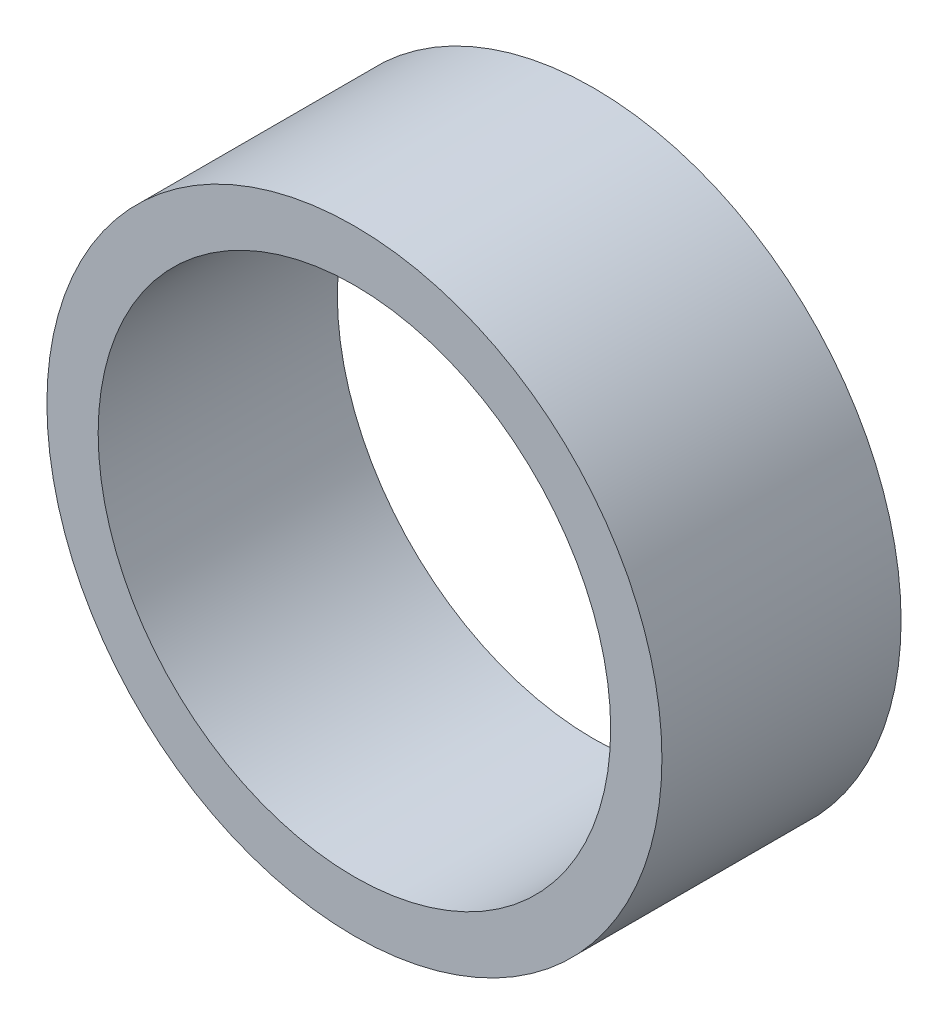
ISO-10303-21;
HEADER;
FILE_DESCRIPTION(('STEP AP214'),'2;1');
FILE_NAME('part.step','',(''),(''),'','','');
FILE_SCHEMA(('AUTOMOTIVE_DESIGN { 1 0 10303 214 1 1 1 1 }'));
ENDSEC;
DATA;
#1=APPLICATION_CONTEXT('core data for automotive mechanical design processes');
#2=APPLICATION_PROTOCOL_DEFINITION('international standard','automotive_design',2000,#1);
#3=PRODUCT_CONTEXT('',#1,'mechanical');
#4=PRODUCT('Part','Part','',(#3));
#5=PRODUCT_RELATED_PRODUCT_CATEGORY('part','',(#4));
#6=PRODUCT_DEFINITION_FORMATION('','',#4);
#7=PRODUCT_DEFINITION_CONTEXT('part definition',#1,'design');
#8=PRODUCT_DEFINITION('design','',#6,#7);
#9=PRODUCT_DEFINITION_SHAPE('','',#8);
#10=(LENGTH_UNIT() NAMED_UNIT(*) SI_UNIT(.MILLI.,.METRE.));
#11=(NAMED_UNIT(*) PLANE_ANGLE_UNIT() SI_UNIT($,.RADIAN.));
#12=(NAMED_UNIT(*) SI_UNIT($,.STERADIAN.) SOLID_ANGLE_UNIT());
#13=UNCERTAINTY_MEASURE_WITH_UNIT(LENGTH_MEASURE(1.E-05),#10,'distance_accuracy_value','');
#14=(GEOMETRIC_REPRESENTATION_CONTEXT(3) GLOBAL_UNCERTAINTY_ASSIGNED_CONTEXT((#13)) GLOBAL_UNIT_ASSIGNED_CONTEXT((#10,
#11,#12)) REPRESENTATION_CONTEXT('',''));
#15=CARTESIAN_POINT('',(0.,0.,0.));
#16=DIRECTION('',(0.,0.,1.));
#17=DIRECTION('',(1.,0.,0.));
#18=AXIS2_PLACEMENT_3D('',#15,#16,#17);
#19=CARTESIAN_POINT('',(0.,0.,7.));
#20=DIRECTION('',(0.,0.,1.));
#21=DIRECTION('',(1.,0.,0.));
#22=AXIS2_PLACEMENT_3D('',#19,#20,#21);
#23=PLANE('',#22);
#24=CARTESIAN_POINT('',(0.,0.,7.));
#25=DIRECTION('',(0.,0.,1.));
#26=DIRECTION('',(1.,0.,0.));
#27=AXIS2_PLACEMENT_3D('',#24,#25,#26);
#28=CIRCLE('',#27,9.);
#29=CARTESIAN_POINT('',(9.,0.,7.));
#30=VERTEX_POINT('',#29);
#31=EDGE_CURVE('E10',#30,#30,#28,.T.);
#32=ORIENTED_EDGE('',*,*,#31,.T.);
#33=EDGE_LOOP('',(#32));
#34=FACE_BOUND('',#33,.T.);
#35=CARTESIAN_POINT('',(0.,0.,7.));
#36=DIRECTION('',(0.,0.,1.));
#37=DIRECTION('',(1.,0.,0.));
#38=AXIS2_PLACEMENT_3D('',#35,#36,#37);
#39=CIRCLE('',#38,7.5);
#40=CARTESIAN_POINT('',(7.5,0.,7.));
#41=VERTEX_POINT('',#40);
#42=EDGE_CURVE('E41',#41,#41,#39,.T.);
#43=ORIENTED_EDGE('',*,*,#42,.F.);
#44=EDGE_LOOP('',(#43));
#45=FACE_BOUND('',#44,.T.);
#46=ADVANCED_FACE('F30',(#34,#45),#23,.T.);
#47=CARTESIAN_POINT('',(0.,0.,0.));
#48=DIRECTION('',(0.,0.,1.));
#49=DIRECTION('',(1.,0.,0.));
#50=AXIS2_PLACEMENT_3D('',#47,#48,#49);
#51=PLANE('',#50);
#52=CARTESIAN_POINT('',(0.,0.,0.));
#53=DIRECTION('',(0.,0.,1.));
#54=DIRECTION('',(1.,0.,0.));
#55=AXIS2_PLACEMENT_3D('',#52,#53,#54);
#56=CIRCLE('',#55,9.);
#57=CARTESIAN_POINT('',(9.,0.,0.));
#58=VERTEX_POINT('',#57);
#59=EDGE_CURVE('E34',#58,#58,#56,.T.);
#60=ORIENTED_EDGE('',*,*,#59,.F.);
#61=EDGE_LOOP('',(#60));
#62=FACE_BOUND('',#61,.T.);
#63=CARTESIAN_POINT('',(0.,0.,0.));
#64=DIRECTION('',(0.,0.,1.));
#65=DIRECTION('',(1.,0.,0.));
#66=AXIS2_PLACEMENT_3D('',#63,#64,#65);
#67=CIRCLE('',#66,7.5);
#68=CARTESIAN_POINT('',(7.5,0.,0.));
#69=VERTEX_POINT('',#68);
#70=EDGE_CURVE('E43',#69,#69,#67,.T.);
#71=ORIENTED_EDGE('',*,*,#70,.T.);
#72=EDGE_LOOP('',(#71));
#73=FACE_BOUND('',#72,.T.);
#74=ADVANCED_FACE('F53',(#62,#73),#51,.F.);
#75=CARTESIAN_POINT('',(0.,0.,7.));
#76=DIRECTION('',(0.,0.,-1.));
#77=DIRECTION('',(-1.,0.,0.));
#78=AXIS2_PLACEMENT_3D('',#75,#76,#77);
#79=CYLINDRICAL_SURFACE('',#78,9.);
#80=ORIENTED_EDGE('',*,*,#31,.F.);
#81=EDGE_LOOP('',(#80));
#82=FACE_BOUND('',#81,.T.);
#83=ORIENTED_EDGE('',*,*,#59,.T.);
#84=EDGE_LOOP('',(#83));
#85=FACE_BOUND('',#84,.T.);
#86=ADVANCED_FACE('F32',(#82,#85),#79,.T.);
#87=CARTESIAN_POINT('',(0.,0.,7.));
#88=DIRECTION('',(0.,0.,-1.));
#89=DIRECTION('',(-1.,0.,0.));
#90=AXIS2_PLACEMENT_3D('',#87,#88,#89);
#91=CYLINDRICAL_SURFACE('',#90,7.5);
#92=ORIENTED_EDGE('',*,*,#42,.T.);
#93=EDGE_LOOP('',(#92));
#94=FACE_BOUND('',#93,.T.);
#95=ORIENTED_EDGE('',*,*,#70,.F.);
#96=EDGE_LOOP('',(#95));
#97=FACE_BOUND('',#96,.T.);
#98=ADVANCED_FACE('F49',(#94,#97),#91,.F.);
#99=CLOSED_SHELL('',(#46,#74,#86,#98));
#100=MANIFOLD_SOLID_BREP('B2',#99);
#101=ADVANCED_BREP_SHAPE_REPRESENTATION('',(#18,#100),#14);
#102=SHAPE_DEFINITION_REPRESENTATION(#9,#101);
ENDSEC;
END-ISO-10303-21;
